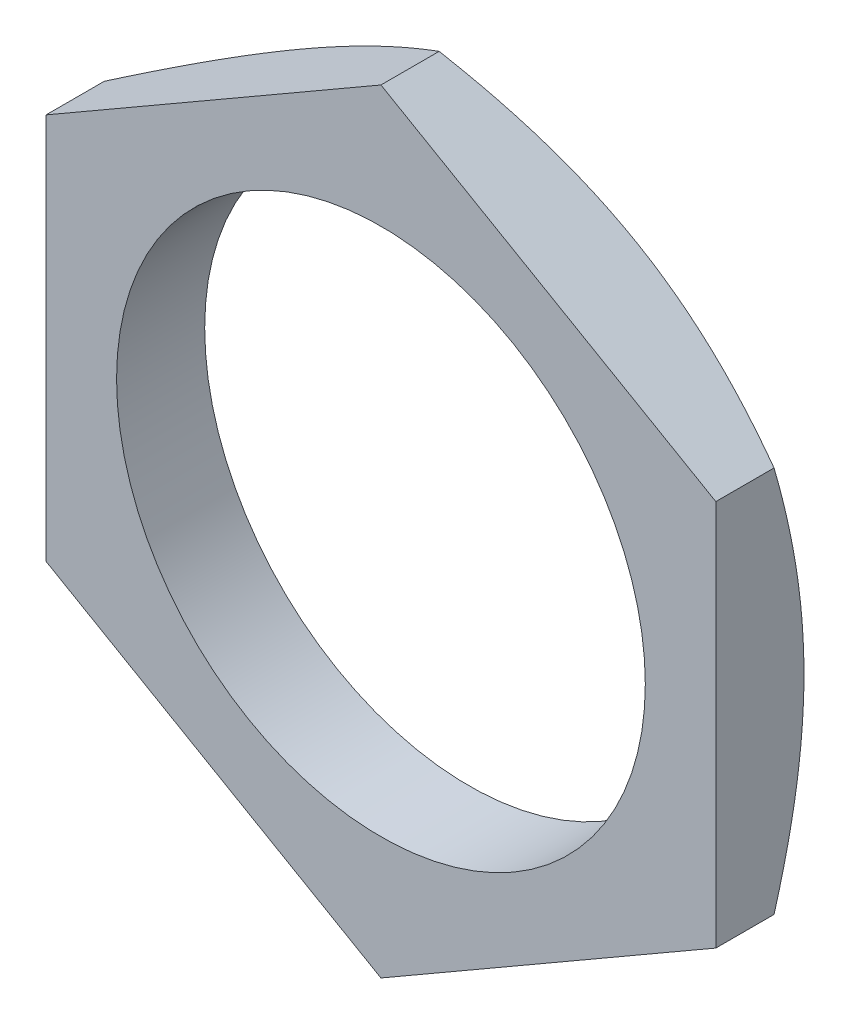
ISO-10303-21;
HEADER;
FILE_DESCRIPTION(('STEP AP214'),'2;1');
FILE_NAME('part.step','',(''),(''),'','','');
FILE_SCHEMA(('AUTOMOTIVE_DESIGN { 1 0 10303 214 1 1 1 1 }'));
ENDSEC;
DATA;
#1=APPLICATION_CONTEXT('core data for automotive mechanical design processes');
#2=APPLICATION_PROTOCOL_DEFINITION('international standard','automotive_design',2000,#1);
#3=PRODUCT_CONTEXT('',#1,'mechanical');
#4=PRODUCT('Part','Part','',(#3));
#5=PRODUCT_RELATED_PRODUCT_CATEGORY('part','',(#4));
#6=PRODUCT_DEFINITION_FORMATION('','',#4);
#7=PRODUCT_DEFINITION_CONTEXT('part definition',#1,'design');
#8=PRODUCT_DEFINITION('design','',#6,#7);
#9=PRODUCT_DEFINITION_SHAPE('','',#8);
#10=(LENGTH_UNIT() NAMED_UNIT(*) SI_UNIT(.MILLI.,.METRE.));
#11=(NAMED_UNIT(*) PLANE_ANGLE_UNIT() SI_UNIT($,.RADIAN.));
#12=(NAMED_UNIT(*) SI_UNIT($,.STERADIAN.) SOLID_ANGLE_UNIT());
#13=UNCERTAINTY_MEASURE_WITH_UNIT(LENGTH_MEASURE(1.E-05),#10,'distance_accuracy_value','');
#14=(GEOMETRIC_REPRESENTATION_CONTEXT(3) GLOBAL_UNCERTAINTY_ASSIGNED_CONTEXT((#13)) GLOBAL_UNIT_ASSIGNED_CONTEXT((#10,
#11,#12)) REPRESENTATION_CONTEXT('',''));
#15=CARTESIAN_POINT('',(0.,0.,0.));
#16=DIRECTION('',(0.,0.,1.));
#17=DIRECTION('',(1.,0.,0.));
#18=AXIS2_PLACEMENT_3D('',#15,#16,#17);
#19=CARTESIAN_POINT('',(0.,0.,-1.25));
#20=DIRECTION('',(0.,0.,1.));
#21=DIRECTION('',(1.,0.,0.));
#22=AXIS2_PLACEMENT_3D('',#19,#20,#21);
#23=PLANE('',#22);
#24=CARTESIAN_POINT('',(0.,0.,-1.25));
#25=DIRECTION('',(0.,0.,1.));
#26=DIRECTION('',(1.,0.,0.));
#27=AXIS2_PLACEMENT_3D('',#24,#25,#26);
#28=CIRCLE('',#27,7.5);
#29=CARTESIAN_POINT('',(7.5,0.,-1.25));
#30=VERTEX_POINT('',#29);
#31=EDGE_CURVE('E262',#30,#30,#28,.T.);
#32=ORIENTED_EDGE('',*,*,#31,.T.);
#33=EDGE_LOOP('',(#32));
#34=FACE_BOUND('',#33,.T.);
#35=CARTESIAN_POINT('',(0.,0.,-1.25));
#36=DIRECTION('',(0.,0.,1.));
#37=DIRECTION('',(1.,0.,0.));
#38=AXIS2_PLACEMENT_3D('',#35,#36,#37);
#39=CIRCLE('',#38,9.50000000000002);
#40=CARTESIAN_POINT('',(9.5,0.,-1.25));
#41=VERTEX_POINT('',#40);
#42=CARTESIAN_POINT('',(4.74999999999997,8.22724133595223,-1.25));
#43=VERTEX_POINT('',#42);
#44=EDGE_CURVE('E53',#41,#43,#39,.T.);
#45=ORIENTED_EDGE('',*,*,#44,.F.);
#46=CARTESIAN_POINT('',(4.75000000000007,-8.22724133595213,-1.25));
#47=VERTEX_POINT('',#46);
#48=EDGE_CURVE('E141',#47,#41,#39,.T.);
#49=ORIENTED_EDGE('',*,*,#48,.F.);
#50=CARTESIAN_POINT('',(-4.74999999999995,-8.2272413359522,-1.25));
#51=VERTEX_POINT('',#50);
#52=EDGE_CURVE('E138',#51,#47,#39,.T.);
#53=ORIENTED_EDGE('',*,*,#52,.F.);
#54=CARTESIAN_POINT('',(-9.5,0.,-1.25));
#55=VERTEX_POINT('',#54);
#56=EDGE_CURVE('E137',#55,#51,#39,.T.);
#57=ORIENTED_EDGE('',*,*,#56,.F.);
#58=CARTESIAN_POINT('',(-4.75000000000001,8.22724133595216,-1.25));
#59=VERTEX_POINT('',#58);
#60=EDGE_CURVE('E116',#59,#55,#39,.T.);
#61=ORIENTED_EDGE('',*,*,#60,.F.);
#62=EDGE_CURVE('E106',#43,#59,#39,.T.);
#63=ORIENTED_EDGE('',*,*,#62,.F.);
#64=EDGE_LOOP('',(#45,#49,#53,#57,#61,#63));
#65=FACE_BOUND('',#64,.T.);
#66=ADVANCED_FACE('F32',(#34,#65),#23,.F.);
#67=CARTESIAN_POINT('',(9.49999999999994,5.48482755730156,1.25));
#68=DIRECTION('',(-0.499999999999995,-0.866025403784442,0.));
#69=DIRECTION('',(0.866025403784442,-0.499999999999995,0.));
#70=AXIS2_PLACEMENT_3D('',#67,#68,#69);
#71=PLANE('',#70);
#72=CARTESIAN_POINT('',(-0.000199999999999582,10.9697705846567,-0.401427556248842));
#73=CARTESIAN_POINT('',(0.208630771128801,10.8492020827304,-0.471026560670745));
#74=CARTESIAN_POINT('',(0.418240172459711,10.7281840384474,-0.53746669294174));
#75=CARTESIAN_POINT('',(0.839139887725041,10.4851774745371,-0.663152719598927));
#76=CARTESIAN_POINT('',(1.05043073030169,10.3631886496982,-0.722396247814139));
#77=CARTESIAN_POINT('',(1.68770779916433,9.99525656244196,-0.888185424920282));
#78=CARTESIAN_POINT('',(2.11620976424254,9.74786083755577,-0.982485557930612));
#79=CARTESIAN_POINT('',(2.75744333930379,9.37764446038074,-1.09306129475865));
#80=CARTESIAN_POINT('',(2.9682592170635,9.25592985660672,-1.12456017369323));
#81=CARTESIAN_POINT('',(3.39086703940183,9.01193711661805,-1.17738179841102));
#82=CARTESIAN_POINT('',(3.60265900268756,8.88965896960284,-1.19870434833462));
#83=CARTESIAN_POINT('',(4.02659621432081,8.64489870634688,-1.23062697953563));
#84=CARTESIAN_POINT('',(4.23874074133958,8.52241700656549,-1.24123980281126));
#85=CARTESIAN_POINT('',(4.66322575319651,8.27734047070294,-1.25151746883407));
#86=CARTESIAN_POINT('',(4.87556623177766,8.15474563823425,-1.25118264982958));
#87=CARTESIAN_POINT('',(5.27254199174947,7.92555157635278,-1.24032663226187));
#88=CARTESIAN_POINT('',(5.45720529156195,7.8189361704966,-1.23112973362371));
#89=CARTESIAN_POINT('',(5.82610000315547,7.60595470945545,-1.2046346041473));
#90=CARTESIAN_POINT('',(6.01033138345865,7.49958867244424,-1.18733580023108));
#91=CARTESIAN_POINT('',(6.562311670432,7.18090270517281,-1.12369551849081));
#92=CARTESIAN_POINT('',(6.92908353265843,6.9691468717852,-1.06561809950886));
#93=CARTESIAN_POINT('',(7.66651782508359,6.54338898454388,-0.920423984893746));
#94=CARTESIAN_POINT('',(8.0370861426426,6.32944126664804,-0.832691831128564));
#95=CARTESIAN_POINT('',(8.77269671701094,5.90473630351776,-0.633576262580424));
#96=CARTESIAN_POINT('',(9.13774839354395,5.6939736198033,-0.522239613304349));
#97=CARTESIAN_POINT('',(9.50019999999995,5.48471208724772,-0.401427556248841));
#98=B_SPLINE_CURVE_WITH_KNOTS('',3,(#72,#73,#74,#75,#76,#77,#78,#79,#80,#81,#82,#83,#84,#85,#86,
#87,#88,#89,#90,#91,#92,#93,#94,#95,#96,#97),.UNSPECIFIED.,.F.,.F.,(4,2,2,2,2,2,2,2,2,2,2,2,4),
(0.,0.752880503268236,1.50600787988545,3.0154687011471,3.75167336599938,4.48789219970675,
5.22323407372947,5.95855322798176,6.5986808492954,7.23885375606395,8.52010929438162,
9.82978009330486,11.1368800075142),.UNSPECIFIED.);
#99=CARTESIAN_POINT('',(0.,10.9696551146029,-0.401494223968129));
#100=VERTEX_POINT('',#99);
#101=EDGE_CURVE('E112',#100,#43,#98,.T.);
#102=ORIENTED_EDGE('',*,*,#101,.F.);
#103=DIRECTION('',(0.,0.,-1.));
#104=VECTOR('',#103,1.);
#105=CARTESIAN_POINT('',(0.,10.9696551146029,1.25));
#106=LINE('',#105,#104);
#107=CARTESIAN_POINT('',(0.,10.9696551146029,1.25));
#108=VERTEX_POINT('',#107);
#109=EDGE_CURVE('E133',#108,#100,#106,.T.);
#110=ORIENTED_EDGE('',*,*,#109,.F.);
#111=DIRECTION('',(-0.866025403784442,0.499999999999995,0.));
#112=VECTOR('',#111,1.);
#113=CARTESIAN_POINT('',(9.49999999999994,5.48482755730156,1.25));
#114=LINE('',#113,#112);
#115=CARTESIAN_POINT('',(9.49999999999994,5.48482755730156,1.25));
#116=VERTEX_POINT('',#115);
#117=EDGE_CURVE('E228',#116,#108,#114,.T.);
#118=ORIENTED_EDGE('',*,*,#117,.F.);
#119=DIRECTION('',(0.,0.,-1.));
#120=VECTOR('',#119,1.);
#121=CARTESIAN_POINT('',(9.49999999999994,5.48482755730156,1.25));
#122=LINE('',#121,#120);
#123=CARTESIAN_POINT('',(9.49999999999994,5.48482755730156,-0.401494223968129));
#124=VERTEX_POINT('',#123);
#125=EDGE_CURVE('E224',#116,#124,#122,.T.);
#126=ORIENTED_EDGE('',*,*,#125,.T.);
#127=EDGE_CURVE('E149',#43,#124,#98,.T.);
#128=ORIENTED_EDGE('',*,*,#127,.F.);
#129=EDGE_LOOP('',(#102,#110,#118,#126,#128));
#130=FACE_BOUND('',#129,.T.);
#131=ADVANCED_FACE('F34',(#130),#71,.F.);
#132=CARTESIAN_POINT('',(0.,10.9696551146029,1.25));
#133=DIRECTION('',(0.500000000000001,-0.866025403784438,0.));
#134=DIRECTION('',(0.866025403784438,0.500000000000001,0.));
#135=AXIS2_PLACEMENT_3D('',#132,#133,#134);
#136=PLANE('',#135);
#137=CARTESIAN_POINT('',(-9.50020000000002,5.48471208724759,-0.401427556248842));
#138=CARTESIAN_POINT('',(-9.29136922887122,5.60528058917388,-0.471026560670745));
#139=CARTESIAN_POINT('',(-9.08175982754031,5.72629863345696,-0.537466692941741));
#140=CARTESIAN_POINT('',(-8.66086011227499,5.96930519736723,-0.663152719598929));
#141=CARTESIAN_POINT('',(-8.44956926969834,6.09129402220616,-0.722396247814144));
#142=CARTESIAN_POINT('',(-7.8122922008357,6.45922610946238,-0.888185424920289));
#143=CARTESIAN_POINT('',(-7.3837902357575,6.70662183434857,-0.982485557930621));
#144=CARTESIAN_POINT('',(-6.74255666069625,7.0768382115236,-1.09306129475866));
#145=CARTESIAN_POINT('',(-6.53174078293653,7.19855281529762,-1.12456017369325));
#146=CARTESIAN_POINT('',(-6.10913296059821,7.4425455552863,-1.17738179841103));
#147=CARTESIAN_POINT('',(-5.89734099731248,7.56482370230151,-1.19870434833464));
#148=CARTESIAN_POINT('',(-5.47340378567923,7.80958396555747,-1.23062697953565));
#149=CARTESIAN_POINT('',(-5.26125925866047,7.93206566533886,-1.24123980281128));
#150=CARTESIAN_POINT('',(-4.83677424680354,8.17714220120142,-1.25151746883409));
#151=CARTESIAN_POINT('',(-4.62443376822238,8.2997370336701,-1.2511826498296));
#152=CARTESIAN_POINT('',(-4.22745800825057,8.52893109555159,-1.2403266322619));
#153=CARTESIAN_POINT('',(-4.04279470843809,8.63554650140777,-1.23112973362373));
#154=CARTESIAN_POINT('',(-3.67389999684456,8.84852796244892,-1.20463460414733));
#155=CARTESIAN_POINT('',(-3.48966861654138,8.95489399946014,-1.1873358002311));
#156=CARTESIAN_POINT('',(-2.93768832956801,9.27357996673158,-1.12369551849084));
#157=CARTESIAN_POINT('',(-2.57091646734158,9.48533580011919,-1.06561809950888));
#158=CARTESIAN_POINT('',(-1.8334821749164,9.91109368736053,-0.920423984893766));
#159=CARTESIAN_POINT('',(-1.46291385735738,10.1250414052564,-0.832691831128581));
#160=CARTESIAN_POINT('',(-0.727303282989024,10.5497463683867,-0.633576262580434));
#161=CARTESIAN_POINT('',(-0.362251606456,10.7605090521012,-0.522239613304355));
#162=CARTESIAN_POINT('',(0.000199999999999472,10.9697705846567,-0.401427556248843));
#163=B_SPLINE_CURVE_WITH_KNOTS('',3,(#137,#138,#139,#140,#141,#142,#143,#144,#145,#146,#147,
#148,#149,#150,#151,#152,#153,#154,#155,#156,#157,#158,#159,#160,#161,#162),.UNSPECIFIED.,.F.,
.F.,(4,2,2,2,2,2,2,2,2,2,2,2,4),(0.,0.752880503268237,1.50600787988545,3.0154687011471,
3.75167336599938,4.48789219970675,5.22323407372947,5.95855322798175,6.59868084929541,
7.23885375606398,8.52010929438169,9.82978009330497,11.1368800075143),.UNSPECIFIED.);
#164=CARTESIAN_POINT('',(-9.50000000000002,5.48482755730143,-0.401494223968129));
#165=VERTEX_POINT('',#164);
#166=EDGE_CURVE('E120',#165,#59,#163,.T.);
#167=ORIENTED_EDGE('',*,*,#166,.F.);
#168=DIRECTION('',(0.,0.,-1.));
#169=VECTOR('',#168,1.);
#170=CARTESIAN_POINT('',(-9.50000000000002,5.48482755730143,1.25));
#171=LINE('',#170,#169);
#172=CARTESIAN_POINT('',(-9.50000000000002,5.48482755730143,1.25));
#173=VERTEX_POINT('',#172);
#174=EDGE_CURVE('E243',#173,#165,#171,.T.);
#175=ORIENTED_EDGE('',*,*,#174,.F.);
#176=DIRECTION('',(-0.866025403784438,-0.500000000000001,0.));
#177=VECTOR('',#176,1.);
#178=CARTESIAN_POINT('',(0.,10.9696551146029,1.25));
#179=LINE('',#178,#177);
#180=EDGE_CURVE('E258',#108,#173,#179,.T.);
#181=ORIENTED_EDGE('',*,*,#180,.F.);
#182=ORIENTED_EDGE('',*,*,#109,.T.);
#183=EDGE_CURVE('E110',#59,#100,#163,.T.);
#184=ORIENTED_EDGE('',*,*,#183,.F.);
#185=EDGE_LOOP('',(#167,#175,#181,#182,#184));
#186=FACE_BOUND('',#185,.T.);
#187=ADVANCED_FACE('F131',(#186),#136,.F.);
#188=CARTESIAN_POINT('',(-9.50000000000002,5.48482755730143,1.25));
#189=DIRECTION('',(1.,0.,0.));
#190=DIRECTION('',(0.,1.,0.));
#191=AXIS2_PLACEMENT_3D('',#188,#189,#190);
#192=PLANE('',#191);
#193=CARTESIAN_POINT('',(-9.49999999999995,-14.7079788943978,3.374155958332));
#194=CARTESIAN_POINT('',(-9.49999999999995,-14.5006307288716,3.27359815020942));
#195=CARTESIAN_POINT('',(-9.49999999999995,-14.2930385749005,3.17354367379145));
#196=CARTESIAN_POINT('',(-9.49999999999995,-13.8773153771831,2.97455543055369));
#197=CARTESIAN_POINT('',(-9.49999999999995,-13.6691843280153,2.87562167506298));
#198=CARTESIAN_POINT('',(-9.49999999999996,-13.0438506868244,2.5806463174693));
#199=CARTESIAN_POINT('',(-9.49999999999996,-12.6257693215178,2.38646063953774));
#200=CARTESIAN_POINT('',(-9.49999999999996,-11.7845131602671,2.00316650658972));
#201=CARTESIAN_POINT('',(-9.49999999999996,-11.3613230101303,1.81409166895174));
#202=CARTESIAN_POINT('',(-9.49999999999996,-10.5115688794462,1.44370968385378));
#203=CARTESIAN_POINT('',(-9.49999999999997,-10.0850050601623,1.26240216773825));
#204=CARTESIAN_POINT('',(-9.49999999999997,-9.21413533020515,0.903977204363873));
#205=CARTESIAN_POINT('',(-9.49999999999997,-8.76969765563394,0.72717814212782));
#206=CARTESIAN_POINT('',(-9.49999999999997,-7.87561455467819,0.387021041367018));
#207=CARTESIAN_POINT('',(-9.49999999999998,-7.42596854890445,0.223664514930676));
#208=CARTESIAN_POINT('',(-9.49999999999998,-6.52159769136497,-0.0852998939499188));
#209=CARTESIAN_POINT('',(-9.49999999999998,-6.06688532406789,-0.230943925702646));
#210=CARTESIAN_POINT('',(-9.49999999999998,-5.15095439836179,-0.499795379377553));
#211=CARTESIAN_POINT('',(-9.49999999999999,-4.68973794686474,-0.623009894977716));
#212=CARTESIAN_POINT('',(-9.49999999999999,-3.76302432220732,-0.840408236285146));
#213=CARTESIAN_POINT('',(-9.49999999999999,-3.29756500846383,-0.934749077213833));
#214=CARTESIAN_POINT('',(-9.49999999999999,-2.59515733341112,-1.05051038048294));
#215=CARTESIAN_POINT('',(-9.49999999999999,-2.36030084523323,-1.08480740173473));
#216=CARTESIAN_POINT('',(-9.49999999999999,-1.88942899055465,-1.14414483347394));
#217=CARTESIAN_POINT('',(-9.5,-1.65341373804795,-1.1691861367143));
#218=CARTESIAN_POINT('',(-9.5,-1.18361243044764,-1.20920051572179));
#219=CARTESIAN_POINT('',(-9.5,-0.949837184562464,-1.22430001036755));
#220=CARTESIAN_POINT('',(-9.5,-0.481857743709508,-1.24460133661545));
#221=CARTESIAN_POINT('',(-9.5,-0.247653555884057,-1.24980333154818));
#222=CARTESIAN_POINT('',(-9.5,0.220765288540305,-1.25018568392822));
#223=CARTESIAN_POINT('',(-9.5,0.454979945181972,-1.24536599580874));
#224=CARTESIAN_POINT('',(-9.50000000000001,0.922998721514743,-1.22582217709502));
#225=CARTESIAN_POINT('',(-9.50000000000001,1.15680282116077,-1.21109757568162));
#226=CARTESIAN_POINT('',(-9.50000000000001,1.71947456985461,-1.16405380340847));
#227=CARTESIAN_POINT('',(-9.50000000000001,2.04795264613994,-1.12699246927144));
#228=CARTESIAN_POINT('',(-9.50000000000001,2.70245633521692,-1.03534369613785));
#229=CARTESIAN_POINT('',(-9.50000000000001,3.02848160519171,-0.98075385218519));
#230=CARTESIAN_POINT('',(-9.50000000000002,3.67777427176974,-0.85599007984296));
#231=CARTESIAN_POINT('',(-9.50000000000002,4.00103929143227,-0.785803898967145));
#232=CARTESIAN_POINT('',(-9.50000000000002,4.64431932382945,-0.631987935245499));
#233=CARTESIAN_POINT('',(-9.50000000000002,4.96433438758438,-0.548358363792159));
#234=CARTESIAN_POINT('',(-9.50000000000002,5.6081146021438,-0.3677230303214));
#235=CARTESIAN_POINT('',(-9.50000000000002,5.93180829217693,-0.270464339769977));
#236=CARTESIAN_POINT('',(-9.50000000000002,6.57600673937981,-0.0659576509027251));
#237=CARTESIAN_POINT('',(-9.50000000000003,6.89651147581433,0.04129041231913));
#238=CARTESIAN_POINT('',(-9.50000000000003,7.53449123867721,0.264078239098088));
#239=CARTESIAN_POINT('',(-9.50000000000003,7.85196724881548,0.379615198856167));
#240=CARTESIAN_POINT('',(-9.50000000000003,8.48429280752197,0.617627449196389));
#241=CARTESIAN_POINT('',(-9.50000000000003,8.79914238411291,0.740102665641926));
#242=CARTESIAN_POINT('',(-9.50000000000003,9.53071784817658,1.03248685043995));
#243=CARTESIAN_POINT('',(-9.50000000000004,9.94654584506272,1.20463878914685));
#244=CARTESIAN_POINT('',(-9.50000000000004,10.7747506715,1.55707623079383));
#245=CARTESIAN_POINT('',(-9.50000000000004,11.1871273016868,1.73736219979495));
#246=CARTESIAN_POINT('',(-9.50000000000004,12.0090563195389,2.10447149693273));
#247=CARTESIAN_POINT('',(-9.50000000000004,12.4186080982541,2.29129618494771));
#248=CARTESIAN_POINT('',(-9.50000000000005,13.2352621433801,2.67019135242993));
#249=CARTESIAN_POINT('',(-9.50000000000005,13.6423644579757,2.86226172829164));
#250=CARTESIAN_POINT('',(-9.50000000000005,14.4549417559455,3.25088697757543));
#251=CARTESIAN_POINT('',(-9.50000000000005,14.8604145973278,3.44744632238503));
#252=CARTESIAN_POINT('',(-9.50000000000006,15.6696236203006,3.84410624762321));
#253=CARTESIAN_POINT('',(-9.50000000000006,16.0733597949756,4.04420684213727));
#254=CARTESIAN_POINT('',(-9.50000000000006,17.2822735881912,4.64884700431277));
#255=CARTESIAN_POINT('',(-9.50000000000006,18.0852569558603,5.05777339529387));
#256=CARTESIAN_POINT('',(-9.50000000000007,19.6216001832434,5.85019849530869));
#257=CARTESIAN_POINT('',(-9.50000000000007,20.3552954439758,6.23304980433885));
#258=CARTESIAN_POINT('',(-9.50000000000008,21.8199338665655,7.00403559971239));
#259=CARTESIAN_POINT('',(-9.50000000000008,22.5508769363329,7.39217026086917));
#260=CARTESIAN_POINT('',(-9.50000000000009,24.0088561522871,8.17153902822353));
#261=CARTESIAN_POINT('',(-9.50000000000009,24.735897462475,8.5627634894537));
#262=CARTESIAN_POINT('',(-9.50000000000009,26.1882132020147,9.34838788014329));
#263=CARTESIAN_POINT('',(-9.50000000000009,26.9134877232229,9.74278763972031));
#264=CARTESIAN_POINT('',(-9.5000000000001,27.6381086401074,10.1383765367877));
#265=B_SPLINE_CURVE_WITH_KNOTS('',3,(#193,#194,#195,#196,#197,#198,#199,#200,#201,#202,#203,
#204,#205,#206,#207,#208,#209,#210,#211,#212,#213,#214,#215,#216,#217,#218,#219,#220,#221,#222,
#223,#224,#225,#226,#227,#228,#229,#230,#231,#232,#233,#234,#235,#236,#237,#238,#239,#240,#241,
#242,#243,#244,#245,#246,#247,#248,#249,#250,#251,#252,#253,#254,#255,#256,#257,#258,#259,#260,
#261,#262,#263,#264),.UNSPECIFIED.,.F.,.F.,(4,2,2,2,2,2,2,2,2,2,2,2,2,2,2,2,2,2,2,2,2,2,2,2,2,2,
2,2,2,2,2,2,2,2,2,4),(0.,0.691335284424846,1.38267755115709,2.76556796834412,4.15602946982344,
5.54642490341387,6.98119349135733,8.41612324976779,9.84807349267005,11.2795700695654,
12.7031378706964,13.4150267995164,14.1268470457241,14.8294314736489,15.5320043072791,
16.2345803353884,16.9371897620366,17.9283274439839,18.9196011706882,19.9116564128484,
20.9036960568216,21.9174715361521,22.9312536029561,23.9446943505328,24.9581242713421,
26.3081721330776,27.6582974478982,29.0087052408835,30.3590863817507,31.7108769622188,
33.0626729206971,35.7659302281154,38.2486385252322,40.7314291698439,43.2082758110217,
45.6849908069675),.UNSPECIFIED.);
#266=CARTESIAN_POINT('',(-9.49999999999998,-5.48482755730149,-0.401494223968129));
#267=VERTEX_POINT('',#266);
#268=EDGE_CURVE('E263',#267,#55,#265,.T.);
#269=ORIENTED_EDGE('',*,*,#268,.F.);
#270=DIRECTION('',(0.,0.,-1.));
#271=VECTOR('',#270,1.);
#272=CARTESIAN_POINT('',(-9.49999999999998,-5.48482755730149,1.25));
#273=LINE('',#272,#271);
#274=CARTESIAN_POINT('',(-9.49999999999998,-5.48482755730149,1.25));
#275=VERTEX_POINT('',#274);
#276=EDGE_CURVE('E240',#275,#267,#273,.T.);
#277=ORIENTED_EDGE('',*,*,#276,.F.);
#278=DIRECTION('',(0.,-1.,0.));
#279=VECTOR('',#278,1.);
#280=CARTESIAN_POINT('',(-9.50000000000002,5.48482755730143,1.25));
#281=LINE('',#280,#279);
#282=EDGE_CURVE('E254',#173,#275,#281,.T.);
#283=ORIENTED_EDGE('',*,*,#282,.F.);
#284=ORIENTED_EDGE('',*,*,#174,.T.);
#285=EDGE_CURVE('E124',#55,#165,#265,.T.);
#286=ORIENTED_EDGE('',*,*,#285,.F.);
#287=EDGE_LOOP('',(#269,#277,#283,#284,#286));
#288=FACE_BOUND('',#287,.T.);
#289=ADVANCED_FACE('F190',(#288),#192,.F.);
#290=CARTESIAN_POINT('',(-9.49999999999998,-5.48482755730149,1.25));
#291=DIRECTION('',(0.499999999999995,0.866025403784442,0.));
#292=DIRECTION('',(-0.866025403784441,0.499999999999995,0.));
#293=AXIS2_PLACEMENT_3D('',#290,#291,#292);
#294=PLANE('',#293);
#295=CARTESIAN_POINT('',(0.000200000000076601,-10.9697705846567,-0.401427556248843));
#296=CARTESIAN_POINT('',(-0.208630771128724,-10.8492020827304,-0.471026560670746));
#297=CARTESIAN_POINT('',(-0.418240172459633,-10.7281840384474,-0.537466692941741));
#298=CARTESIAN_POINT('',(-0.839139887724963,-10.4851774745371,-0.663152719598929));
#299=CARTESIAN_POINT('',(-1.05043073030161,-10.3631886496982,-0.722396247814143));
#300=CARTESIAN_POINT('',(-1.68770779916425,-9.99525656244196,-0.888185424920289));
#301=CARTESIAN_POINT('',(-2.11620976424246,-9.74786083755578,-0.982485557930622));
#302=CARTESIAN_POINT('',(-2.75744333930371,-9.37764446038074,-1.09306129475866));
#303=CARTESIAN_POINT('',(-2.96825921706342,-9.25592985660672,-1.12456017369325));
#304=CARTESIAN_POINT('',(-3.39086703940175,-9.01193711661805,-1.17738179841103));
#305=CARTESIAN_POINT('',(-3.60265900268748,-8.88965896960284,-1.19870434833464));
#306=CARTESIAN_POINT('',(-4.02659621432073,-8.64489870634688,-1.23062697953565));
#307=CARTESIAN_POINT('',(-4.2387407413395,-8.5224170065655,-1.24123980281128));
#308=CARTESIAN_POINT('',(-4.66322575319642,-8.27734047070294,-1.25151746883409));
#309=CARTESIAN_POINT('',(-4.87556623177758,-8.15474563823426,-1.2511826498296));
#310=CARTESIAN_POINT('',(-5.2725419917494,-7.92555157635277,-1.2403266322619));
#311=CARTESIAN_POINT('',(-5.45720529156188,-7.81893617049659,-1.23112973362373));
#312=CARTESIAN_POINT('',(-5.82610000315541,-7.60595470945544,-1.20463460414733));
#313=CARTESIAN_POINT('',(-6.01033138345859,-7.49958867244423,-1.1873358002311));
#314=CARTESIAN_POINT('',(-6.56231167043196,-7.18090270517279,-1.12369551849083));
#315=CARTESIAN_POINT('',(-6.9290835326584,-6.96914687178518,-1.06561809950888));
#316=CARTESIAN_POINT('',(-7.66651782508358,-6.54338898454384,-0.920423984893767));
#317=CARTESIAN_POINT('',(-8.0370861426426,-6.329441266648,-0.832691831128582));
#318=CARTESIAN_POINT('',(-8.77269671701096,-5.9047363035177,-0.633576262580435));
#319=CARTESIAN_POINT('',(-9.13774839354398,-5.69397361980324,-0.522239613304355));
#320=CARTESIAN_POINT('',(-9.50019999999998,-5.48471208724766,-0.401427556248842));
#321=B_SPLINE_CURVE_WITH_KNOTS('',3,(#295,#296,#297,#298,#299,#300,#301,#302,#303,#304,#305,
#306,#307,#308,#309,#310,#311,#312,#313,#314,#315,#316,#317,#318,#319,#320),.UNSPECIFIED.,.F.,
.F.,(4,2,2,2,2,2,2,2,2,2,2,2,4),(0.,0.752880503268235,1.50600787988545,3.0154687011471,
3.75167336599938,4.48789219970675,5.22323407372947,5.95855322798175,6.59868084929541,
7.23885375606398,8.52010929438169,9.82978009330497,11.1368800075143),.UNSPECIFIED.);
#322=CARTESIAN_POINT('',(0.,-10.9696551146029,-0.40149422396813));
#323=VERTEX_POINT('',#322);
#324=EDGE_CURVE('E134',#323,#51,#321,.T.);
#325=ORIENTED_EDGE('',*,*,#324,.F.);
#326=DIRECTION('',(0.,0.,-1.));
#327=VECTOR('',#326,1.);
#328=CARTESIAN_POINT('',(0.,-10.9696551146029,1.25));
#329=LINE('',#328,#327);
#330=CARTESIAN_POINT('',(0.,-10.9696551146029,1.25));
#331=VERTEX_POINT('',#330);
#332=EDGE_CURVE('E232',#331,#323,#329,.T.);
#333=ORIENTED_EDGE('',*,*,#332,.F.);
#334=DIRECTION('',(0.866025403784442,-0.499999999999995,0.));
#335=VECTOR('',#334,1.);
#336=CARTESIAN_POINT('',(-9.49999999999998,-5.48482755730149,1.25));
#337=LINE('',#336,#335);
#338=EDGE_CURVE('E252',#275,#331,#337,.T.);
#339=ORIENTED_EDGE('',*,*,#338,.F.);
#340=ORIENTED_EDGE('',*,*,#276,.T.);
#341=EDGE_CURVE('E128',#51,#267,#321,.T.);
#342=ORIENTED_EDGE('',*,*,#341,.F.);
#343=EDGE_LOOP('',(#325,#333,#339,#340,#342));
#344=FACE_BOUND('',#343,.T.);
#345=ADVANCED_FACE('F193',(#344),#294,.F.);
#346=CARTESIAN_POINT('',(0.,-10.9696551146029,1.25));
#347=DIRECTION('',(-0.500000000000007,0.866025403784434,0.));
#348=DIRECTION('',(-0.866025403784435,-0.500000000000007,0.));
#349=AXIS2_PLACEMENT_3D('',#346,#347,#348);
#350=PLANE('',#349);
#351=CARTESIAN_POINT('',(9.50020000000006,-5.48471208724752,-0.401427556248842));
#352=CARTESIAN_POINT('',(9.29136922887126,-5.60528058917381,-0.471026560670746));
#353=CARTESIAN_POINT('',(9.08175982754035,-5.72629863345689,-0.537466692941742));
#354=CARTESIAN_POINT('',(8.66086011227503,-5.96930519736717,-0.66315271959893));
#355=CARTESIAN_POINT('',(8.44956926969838,-6.0912940222061,-0.722396247814144));
#356=CARTESIAN_POINT('',(7.81229220083575,-6.45922610946232,-0.888185424920289));
#357=CARTESIAN_POINT('',(7.38379023575754,-6.70662183434851,-0.98248555793062));
#358=CARTESIAN_POINT('',(6.7425566606963,-7.07683821152356,-1.09306129475866));
#359=CARTESIAN_POINT('',(6.53174078293658,-7.19855281529758,-1.12456017369325));
#360=CARTESIAN_POINT('',(6.10913296059826,-7.44254555528626,-1.17738179841103));
#361=CARTESIAN_POINT('',(5.89734099731254,-7.56482370230147,-1.19870434833464));
#362=CARTESIAN_POINT('',(5.47340378567929,-7.80958396555743,-1.23062697953565));
#363=CARTESIAN_POINT('',(5.26125925866052,-7.93206566533882,-1.24123980281128));
#364=CARTESIAN_POINT('',(4.8367742468036,-8.17714220120138,-1.25151746883409));
#365=CARTESIAN_POINT('',(4.62443376822244,-8.29973703367007,-1.2511826498296));
#366=CARTESIAN_POINT('',(4.22745800825063,-8.52893109555156,-1.2403266322619));
#367=CARTESIAN_POINT('',(4.04279470843815,-8.63554650140774,-1.23112973362373));
#368=CARTESIAN_POINT('',(3.67389999684462,-8.8485279624489,-1.20463460414733));
#369=CARTESIAN_POINT('',(3.48966861654144,-8.95489399946012,-1.1873358002311));
#370=CARTESIAN_POINT('',(2.93768832956808,-9.27357996673156,-1.12369551849084));
#371=CARTESIAN_POINT('',(2.57091646734164,-9.48533580011918,-1.06561809950888));
#372=CARTESIAN_POINT('',(1.83348217491646,-9.91109368736052,-0.920423984893766));
#373=CARTESIAN_POINT('',(1.46291385735745,-10.1250414052564,-0.832691831128582));
#374=CARTESIAN_POINT('',(0.727303282989098,-10.5497463683867,-0.633576262580435));
#375=CARTESIAN_POINT('',(0.362251606456075,-10.7605090521011,-0.522239613304356));
#376=CARTESIAN_POINT('',(-0.00019999999992334,-10.9697705846567,-0.401427556248842));
#377=B_SPLINE_CURVE_WITH_KNOTS('',3,(#351,#352,#353,#354,#355,#356,#357,#358,#359,#360,#361,
#362,#363,#364,#365,#366,#367,#368,#369,#370,#371,#372,#373,#374,#375,#376),.UNSPECIFIED.,.F.,
.F.,(4,2,2,2,2,2,2,2,2,2,2,2,4),(0.,0.752880503268237,1.50600787988545,3.0154687011471,
3.75167336599938,4.48789219970675,5.22323407372947,5.95855322798175,6.59868084929541,
7.23885375606398,8.52010929438169,9.82978009330497,11.1368800075143),.UNSPECIFIED.);
#378=CARTESIAN_POINT('',(9.50000000000006,-5.48482755730136,-0.40149422396813));
#379=VERTEX_POINT('',#378);
#380=EDGE_CURVE('E140',#379,#47,#377,.T.);
#381=ORIENTED_EDGE('',*,*,#380,.F.);
#382=DIRECTION('',(0.,0.,-1.));
#383=VECTOR('',#382,1.);
#384=CARTESIAN_POINT('',(9.50000000000006,-5.48482755730136,1.25));
#385=LINE('',#384,#383);
#386=CARTESIAN_POINT('',(9.50000000000006,-5.48482755730136,1.25));
#387=VERTEX_POINT('',#386);
#388=EDGE_CURVE('E229',#387,#379,#385,.T.);
#389=ORIENTED_EDGE('',*,*,#388,.F.);
#390=DIRECTION('',(0.866025403784435,0.500000000000007,0.));
#391=VECTOR('',#390,1.);
#392=CARTESIAN_POINT('',(0.,-10.9696551146029,1.25));
#393=LINE('',#392,#391);
#394=EDGE_CURVE('E234',#331,#387,#393,.T.);
#395=ORIENTED_EDGE('',*,*,#394,.F.);
#396=ORIENTED_EDGE('',*,*,#332,.T.);
#397=EDGE_CURVE('E150',#47,#323,#377,.T.);
#398=ORIENTED_EDGE('',*,*,#397,.F.);
#399=EDGE_LOOP('',(#381,#389,#395,#396,#398));
#400=FACE_BOUND('',#399,.T.);
#401=ADVANCED_FACE('F156',(#400),#350,.F.);
#402=CARTESIAN_POINT('',(9.50000000000006,-5.48482755730136,1.25));
#403=DIRECTION('',(-1.,0.,0.));
#404=DIRECTION('',(0.,-1.,0.));
#405=AXIS2_PLACEMENT_3D('',#402,#403,#404);
#406=PLANE('',#405);
#407=CARTESIAN_POINT('',(9.50000000000015,-14.7079788942457,3.37415595825828));
#408=CARTESIAN_POINT('',(9.50000000000015,-14.500630728722,3.27359815013724));
#409=CARTESIAN_POINT('',(9.50000000000015,-14.2930385747535,3.17354367372082));
#410=CARTESIAN_POINT('',(9.50000000000015,-13.8773153770412,2.97455543048614));
#411=CARTESIAN_POINT('',(9.50000000000014,-13.6691843278759,2.87562167499697));
#412=CARTESIAN_POINT('',(9.50000000000014,-13.0438506866927,2.58064631740791));
#413=CARTESIAN_POINT('',(9.50000000000013,-12.6257693213912,2.38646063947942));
#414=CARTESIAN_POINT('',(9.50000000000012,-11.7845131601509,2.00316650653754));
#415=CARTESIAN_POINT('',(9.50000000000012,-11.3613230100192,1.81409166890263));
#416=CARTESIAN_POINT('',(9.50000000000011,-10.5115688793457,1.44370968381077));
#417=CARTESIAN_POINT('',(9.50000000000011,-10.085005060067,1.26240216769826));
#418=CARTESIAN_POINT('',(9.5000000000001,-9.21413533012068,0.903977204329998));
#419=CARTESIAN_POINT('',(9.50000000000009,-8.7696976555551,0.727178142097032));
#420=CARTESIAN_POINT('',(9.50000000000008,-7.87561455461071,0.387021041342238));
#421=CARTESIAN_POINT('',(9.50000000000008,-7.42596854884269,0.223664514908816));
#422=CARTESIAN_POINT('',(9.50000000000007,-6.52159769131477,-0.0852998939662241));
#423=CARTESIAN_POINT('',(9.50000000000007,-6.06688532402351,-0.230943925716316));
#424=CARTESIAN_POINT('',(9.50000000000006,-5.15095439832923,-0.49979537938639));
#425=CARTESIAN_POINT('',(9.50000000000005,-4.68973794683817,-0.623009894984356));
#426=CARTESIAN_POINT('',(9.50000000000004,-3.76302432219587,-0.840408236287367));
#427=CARTESIAN_POINT('',(9.50000000000004,-3.29756500846155,-0.93474907721401));
#428=CARTESIAN_POINT('',(9.50000000000003,-2.59515733342275,-1.0505103804811));
#429=CARTESIAN_POINT('',(9.50000000000003,-2.36030084524952,-1.08480740173238));
#430=CARTESIAN_POINT('',(9.50000000000002,-1.88942899058029,-1.14414483347097));
#431=CARTESIAN_POINT('',(9.50000000000002,-1.65341373807829,-1.16918613671121));
#432=CARTESIAN_POINT('',(9.50000000000001,-1.18361243048728,-1.20920051571889));
#433=CARTESIAN_POINT('',(9.50000000000001,-0.949837184606711,-1.22430001036493));
#434=CARTESIAN_POINT('',(9.50000000000001,-0.481857743762945,-1.24460133661382));
#435=CARTESIAN_POINT('',(9.5,-0.247653555942084,-1.24980333154724));
#436=CARTESIAN_POINT('',(9.5,0.220765288473134,-1.25018568392906));
#437=CARTESIAN_POINT('',(9.5,0.454979945110249,-1.24536599581067));
#438=CARTESIAN_POINT('',(9.49999999999999,0.922998721433974,-1.22582217709948));
#439=CARTESIAN_POINT('',(9.49999999999999,1.15680282107551,-1.21109757568752));
#440=CARTESIAN_POINT('',(9.49999999999998,1.7194745697623,-1.16405380341794));
#441=CARTESIAN_POINT('',(9.49999999999998,2.0479526460451,-1.12699246928297));
#442=CARTESIAN_POINT('',(9.49999999999997,2.70245633511712,-1.03534369615361));
#443=CARTESIAN_POINT('',(9.49999999999997,3.02848160508949,-0.980753852203125));
#444=CARTESIAN_POINT('',(9.49999999999996,3.67777427166276,-0.855990079865275));
#445=CARTESIAN_POINT('',(9.49999999999996,4.00103929132295,-0.78580389899167));
#446=CARTESIAN_POINT('',(9.49999999999995,4.64431932371553,-0.631987935274419));
#447=CARTESIAN_POINT('',(9.49999999999995,4.96433438746818,-0.548358363823267));
#448=CARTESIAN_POINT('',(9.49999999999994,5.608114602023,-0.367723030356895));
#449=CARTESIAN_POINT('',(9.49999999999994,5.93180829205381,-0.270464339807673));
#450=CARTESIAN_POINT('',(9.49999999999993,6.57600673925206,-0.0659576509447558));
#451=CARTESIAN_POINT('',(9.49999999999993,6.89651147568428,0.0412904122749647));
#452=CARTESIAN_POINT('',(9.49999999999992,7.53449123854257,0.264078239049725));
#453=CARTESIAN_POINT('',(9.49999999999992,7.85196724867854,0.379615198805741));
#454=CARTESIAN_POINT('',(9.49999999999991,8.48429280738046,0.617627449141906));
#455=CARTESIAN_POINT('',(9.49999999999991,8.79914238396911,0.740102665585448));
#456=CARTESIAN_POINT('',(9.4999999999999,9.53071784803116,1.03248685038039));
#457=CARTESIAN_POINT('',(9.4999999999999,9.94654584491794,1.2046387890863));
#458=CARTESIAN_POINT('',(9.49999999999989,10.7747506713564,1.55707623073156));
#459=CARTESIAN_POINT('',(9.49999999999988,11.1871273015438,1.73736219973192));
#460=CARTESIAN_POINT('',(9.49999999999988,12.0090563193969,2.10447149686838));
#461=CARTESIAN_POINT('',(9.49999999999987,12.4186080981127,2.29129618488277));
#462=CARTESIAN_POINT('',(9.49999999999986,13.2352621432396,2.67019135236397));
#463=CARTESIAN_POINT('',(9.49999999999986,13.6423644578357,2.86226172822524));
#464=CARTESIAN_POINT('',(9.49999999999985,14.4549417558064,3.25088697750824));
#465=CARTESIAN_POINT('',(9.49999999999985,14.8604145971891,3.4474463223175));
#466=CARTESIAN_POINT('',(9.49999999999984,15.6696236201628,3.84410624755509));
#467=CARTESIAN_POINT('',(9.49999999999983,16.0733597948382,4.04420684206889));
#468=CARTESIAN_POINT('',(9.49999999999982,17.2822735880549,4.64884700424371));
#469=CARTESIAN_POINT('',(9.49999999999981,18.0852569557248,5.05777339522448));
#470=CARTESIAN_POINT('',(9.4999999999998,19.6216001831087,5.85019849523857));
#471=CARTESIAN_POINT('',(9.49999999999979,20.3552954438412,6.23304980426833));
#472=CARTESIAN_POINT('',(9.49999999999977,21.8199338664311,7.00403559964112));
#473=CARTESIAN_POINT('',(9.49999999999977,22.5508769361985,7.39217026079758));
#474=CARTESIAN_POINT('',(9.49999999999975,24.0088561521528,8.17153902815131));
#475=CARTESIAN_POINT('',(9.49999999999974,24.7358974623406,8.56276348938118));
#476=CARTESIAN_POINT('',(9.49999999999973,26.1882132018802,9.3483878800702));
#477=CARTESIAN_POINT('',(9.49999999999972,26.9134877230883,9.74278763964696));
#478=CARTESIAN_POINT('',(9.49999999999971,27.6381086399727,10.1383765367141));
#479=B_SPLINE_CURVE_WITH_KNOTS('',3,(#407,#408,#409,#410,#411,#412,#413,#414,#415,#416,#417,
#418,#419,#420,#421,#422,#423,#424,#425,#426,#427,#428,#429,#430,#431,#432,#433,#434,#435,#436,
#437,#438,#439,#440,#441,#442,#443,#444,#445,#446,#447,#448,#449,#450,#451,#452,#453,#454,#455,
#456,#457,#458,#459,#460,#461,#462,#463,#464,#465,#466,#467,#468,#469,#470,#471,#472,#473,#474,
#475,#476,#477,#478),.UNSPECIFIED.,.F.,.F.,(4,2,2,2,2,2,2,2,2,2,2,2,2,2,2,2,2,2,2,2,2,2,2,2,2,2,
2,2,2,2,2,2,2,2,2,4),(0.,0.691335284415937,1.38267755113927,2.76556796830848,4.15602946976977,
5.54642490334218,6.98119349126652,8.41612324965786,9.84807349254106,11.2795700694174,
12.7031378705203,13.4150267993262,14.1268470455199,14.8294314734309,15.5320043070475,
16.234580335143,16.9371897617775,17.9283274437166,18.9196011704127,19.9116564125646,
20.9036960565295,21.9174715358514,22.9312536026469,23.944694350215,24.9581242710158,
26.3081721327519,27.6582974475731,29.0087052405591,30.359086381427,31.7108769618958,
33.0626729203748,35.7659302277946,38.2486385249111,40.7314291695225,43.2082758106998,
45.684990806645),.UNSPECIFIED.);
#480=EDGE_CURVE('E11',#124,#41,#479,.F.);
#481=ORIENTED_EDGE('',*,*,#480,.F.);
#482=ORIENTED_EDGE('',*,*,#125,.F.);
#483=DIRECTION('',(0.,1.,0.));
#484=VECTOR('',#483,1.);
#485=CARTESIAN_POINT('',(9.50000000000006,-5.48482755730136,1.25));
#486=LINE('',#485,#484);
#487=EDGE_CURVE('E230',#387,#116,#486,.T.);
#488=ORIENTED_EDGE('',*,*,#487,.F.);
#489=ORIENTED_EDGE('',*,*,#388,.T.);
#490=EDGE_CURVE('E37',#41,#379,#479,.F.);
#491=ORIENTED_EDGE('',*,*,#490,.F.);
#492=EDGE_LOOP('',(#481,#482,#488,#489,#491));
#493=FACE_BOUND('',#492,.T.);
#494=ADVANCED_FACE('F201',(#493),#406,.F.);
#495=CARTESIAN_POINT('',(0.,0.,1.25));
#496=DIRECTION('',(0.,0.,1.));
#497=DIRECTION('',(1.,0.,0.));
#498=AXIS2_PLACEMENT_3D('',#495,#496,#497);
#499=PLANE('',#498);
#500=ORIENTED_EDGE('',*,*,#117,.T.);
#501=ORIENTED_EDGE('',*,*,#180,.T.);
#502=ORIENTED_EDGE('',*,*,#282,.T.);
#503=ORIENTED_EDGE('',*,*,#338,.T.);
#504=ORIENTED_EDGE('',*,*,#394,.T.);
#505=ORIENTED_EDGE('',*,*,#487,.T.);
#506=EDGE_LOOP('',(#500,#501,#502,#503,#504,#505));
#507=FACE_BOUND('',#506,.T.);
#508=CARTESIAN_POINT('',(0.,0.,1.25));
#509=DIRECTION('',(0.,0.,1.));
#510=DIRECTION('',(1.,0.,0.));
#511=AXIS2_PLACEMENT_3D('',#508,#509,#510);
#512=CIRCLE('',#511,7.5);
#513=CARTESIAN_POINT('',(7.5,0.,1.25));
#514=VERTEX_POINT('',#513);
#515=EDGE_CURVE('E261',#514,#514,#512,.T.);
#516=ORIENTED_EDGE('',*,*,#515,.F.);
#517=EDGE_LOOP('',(#516));
#518=FACE_BOUND('',#517,.T.);
#519=ADVANCED_FACE('F212',(#507,#518),#499,.T.);
#520=CARTESIAN_POINT('',(0.,0.,1.25));
#521=DIRECTION('',(0.,0.,-1.));
#522=DIRECTION('',(-1.,0.,0.));
#523=AXIS2_PLACEMENT_3D('',#520,#521,#522);
#524=CYLINDRICAL_SURFACE('',#523,7.5);
#525=ORIENTED_EDGE('',*,*,#515,.T.);
#526=EDGE_LOOP('',(#525));
#527=FACE_BOUND('',#526,.T.);
#528=ORIENTED_EDGE('',*,*,#31,.F.);
#529=EDGE_LOOP('',(#528));
#530=FACE_BOUND('',#529,.T.);
#531=ADVANCED_FACE('F166',(#527,#530),#524,.F.);
#532=CARTESIAN_POINT('',(0.,0.,0.757764007928356));
#533=DIRECTION('',(0.,0.,1.));
#534=DIRECTION('',(1.,0.,0.));
#535=AXIS2_PLACEMENT_3D('',#532,#533,#534);
#536=CONICAL_SURFACE('',#535,12.9775492713401,1.0471975511966);
#537=ORIENTED_EDGE('',*,*,#380,.T.);
#538=ORIENTED_EDGE('',*,*,#48,.T.);
#539=ORIENTED_EDGE('',*,*,#490,.T.);
#540=EDGE_LOOP('',(#537,#538,#539));
#541=FACE_BOUND('',#540,.T.);
#542=ADVANCED_FACE('F165',(#541),#536,.T.);
#543=ORIENTED_EDGE('',*,*,#127,.T.);
#544=ORIENTED_EDGE('',*,*,#480,.T.);
#545=ORIENTED_EDGE('',*,*,#44,.T.);
#546=EDGE_LOOP('',(#543,#544,#545));
#547=FACE_BOUND('',#546,.T.);
#548=ADVANCED_FACE('F273',(#547),#536,.T.);
#549=ORIENTED_EDGE('',*,*,#324,.T.);
#550=ORIENTED_EDGE('',*,*,#52,.T.);
#551=ORIENTED_EDGE('',*,*,#397,.T.);
#552=EDGE_LOOP('',(#549,#550,#551));
#553=FACE_BOUND('',#552,.T.);
#554=ADVANCED_FACE('F163',(#553),#536,.T.);
#555=ORIENTED_EDGE('',*,*,#268,.T.);
#556=ORIENTED_EDGE('',*,*,#56,.T.);
#557=ORIENTED_EDGE('',*,*,#341,.T.);
#558=EDGE_LOOP('',(#555,#556,#557));
#559=FACE_BOUND('',#558,.T.);
#560=ADVANCED_FACE('F159',(#559),#536,.T.);
#561=ORIENTED_EDGE('',*,*,#285,.T.);
#562=ORIENTED_EDGE('',*,*,#166,.T.);
#563=ORIENTED_EDGE('',*,*,#60,.T.);
#564=EDGE_LOOP('',(#561,#562,#563));
#565=FACE_BOUND('',#564,.T.);
#566=ADVANCED_FACE('F121',(#565),#536,.T.);
#567=ORIENTED_EDGE('',*,*,#183,.T.);
#568=ORIENTED_EDGE('',*,*,#101,.T.);
#569=ORIENTED_EDGE('',*,*,#62,.T.);
#570=EDGE_LOOP('',(#567,#568,#569));
#571=FACE_BOUND('',#570,.T.);
#572=ADVANCED_FACE('F108',(#571),#536,.T.);
#573=CLOSED_SHELL('',(#66,#131,#187,#289,#345,#401,#494,#519,#531,#542,#548,#554,#560,#566,#572));
#574=MANIFOLD_SOLID_BREP('B2',#573);
#575=ADVANCED_BREP_SHAPE_REPRESENTATION('',(#18,#574),#14);
#576=SHAPE_DEFINITION_REPRESENTATION(#9,#575);
ENDSEC;
END-ISO-10303-21;
